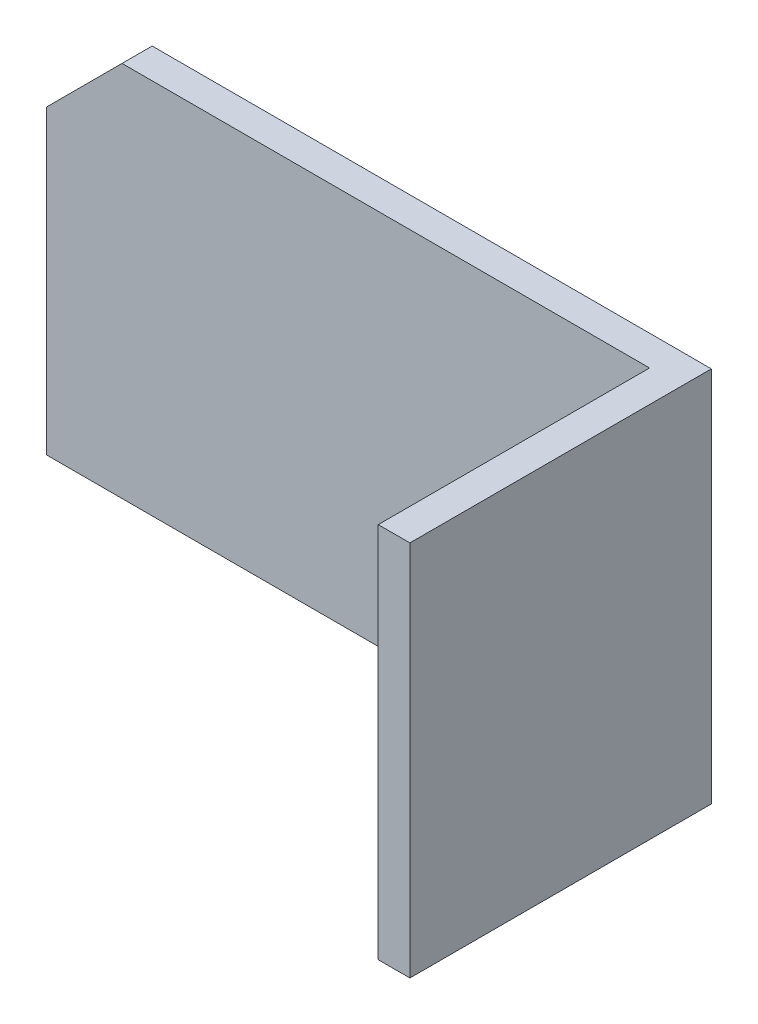
ISO-10303-21;
HEADER;
FILE_DESCRIPTION(('STEP AP214'),'2;1');
FILE_NAME('part.step','',(''),(''),'','','');
FILE_SCHEMA(('AUTOMOTIVE_DESIGN { 1 0 10303 214 1 1 1 1 }'));
ENDSEC;
DATA;
#1=APPLICATION_CONTEXT('core data for automotive mechanical design processes');
#2=APPLICATION_PROTOCOL_DEFINITION('international standard','automotive_design',2000,#1);
#3=PRODUCT_CONTEXT('',#1,'mechanical');
#4=PRODUCT('Part','Part','',(#3));
#5=PRODUCT_RELATED_PRODUCT_CATEGORY('part','',(#4));
#6=PRODUCT_DEFINITION_FORMATION('','',#4);
#7=PRODUCT_DEFINITION_CONTEXT('part definition',#1,'design');
#8=PRODUCT_DEFINITION('design','',#6,#7);
#9=PRODUCT_DEFINITION_SHAPE('','',#8);
#10=(LENGTH_UNIT() NAMED_UNIT(*) SI_UNIT(.MILLI.,.METRE.));
#11=(NAMED_UNIT(*) PLANE_ANGLE_UNIT() SI_UNIT($,.RADIAN.));
#12=(NAMED_UNIT(*) SI_UNIT($,.STERADIAN.) SOLID_ANGLE_UNIT());
#13=UNCERTAINTY_MEASURE_WITH_UNIT(LENGTH_MEASURE(1.E-05),#10,'distance_accuracy_value','');
#14=(GEOMETRIC_REPRESENTATION_CONTEXT(3) GLOBAL_UNCERTAINTY_ASSIGNED_CONTEXT((#13)) GLOBAL_UNIT_ASSIGNED_CONTEXT((#10,
#11,#12)) REPRESENTATION_CONTEXT('',''));
#15=CARTESIAN_POINT('',(0.,0.,0.));
#16=DIRECTION('',(0.,0.,1.));
#17=DIRECTION('',(1.,0.,0.));
#18=AXIS2_PLACEMENT_3D('',#15,#16,#17);
#19=CARTESIAN_POINT('',(1.48217930040456,0.75,0.2));
#20=DIRECTION('',(0.,0.,1.));
#21=DIRECTION('',(1.,0.,0.));
#22=AXIS2_PLACEMENT_3D('',#19,#20,#21);
#23=PLANE('',#22);
#24=DIRECTION('',(0.,-1.,0.));
#25=VECTOR('',#24,1.);
#26=CARTESIAN_POINT('',(1.49267930040456,0.75,0.2));
#27=LINE('',#26,#25);
#28=CARTESIAN_POINT('',(1.49267930040456,0.875,0.2));
#29=VERTEX_POINT('',#28);
#30=CARTESIAN_POINT('',(1.49267930040456,0.625,0.2));
#31=VERTEX_POINT('',#30);
#32=EDGE_CURVE('E94',#29,#31,#27,.T.);
#33=ORIENTED_EDGE('',*,*,#32,.F.);
#34=DIRECTION('',(1.,0.,0.));
#35=VECTOR('',#34,1.);
#36=CARTESIAN_POINT('',(1.36234567518565,0.875,0.2));
#37=LINE('',#36,#35);
#38=CARTESIAN_POINT('',(1.47167930040457,0.875,0.2));
#39=VERTEX_POINT('',#38);
#40=EDGE_CURVE('E92',#39,#29,#37,.T.);
#41=ORIENTED_EDGE('',*,*,#40,.F.);
#42=DIRECTION('',(0.,-1.,0.));
#43=VECTOR('',#42,1.);
#44=CARTESIAN_POINT('',(1.47167930040457,0.75,0.2));
#45=LINE('',#44,#43);
#46=CARTESIAN_POINT('',(1.47167930040457,0.625,0.2));
#47=VERTEX_POINT('',#46);
#48=EDGE_CURVE('E11',#39,#47,#45,.T.);
#49=ORIENTED_EDGE('',*,*,#48,.T.);
#50=DIRECTION('',(1.,0.,0.));
#51=VECTOR('',#50,1.);
#52=CARTESIAN_POINT('',(1.34015031489732,0.625,0.2));
#53=LINE('',#52,#51);
#54=EDGE_CURVE('E67',#47,#31,#53,.T.);
#55=ORIENTED_EDGE('',*,*,#54,.T.);
#56=EDGE_LOOP('',(#33,#41,#49,#55));
#57=FACE_BOUND('',#56,.T.);
#58=ADVANCED_FACE('F17',(#57),#23,.T.);
#59=CARTESIAN_POINT('',(1.27669667488565,0.746711342510851,0.02));
#60=DIRECTION('',(0.,0.,1.));
#61=DIRECTION('',(1.,0.,0.));
#62=AXIS2_PLACEMENT_3D('',#59,#60,#61);
#63=PLANE('',#62);
#64=DIRECTION('',(0.,-1.,0.));
#65=VECTOR('',#64,1.);
#66=CARTESIAN_POINT('',(1.07167930040456,0.725,0.02));
#67=LINE('',#66,#65);
#68=CARTESIAN_POINT('',(1.07167930040456,0.825,0.02));
#69=VERTEX_POINT('',#68);
#70=CARTESIAN_POINT('',(1.07167930040456,0.625,0.02));
#71=VERTEX_POINT('',#70);
#72=EDGE_CURVE('E117',#69,#71,#67,.T.);
#73=ORIENTED_EDGE('',*,*,#72,.T.);
#74=DIRECTION('',(1.,0.,0.));
#75=VECTOR('',#74,1.);
#76=CARTESIAN_POINT('',(1.34015031489732,0.625,0.02));
#77=LINE('',#76,#75);
#78=CARTESIAN_POINT('',(1.47167930040457,0.625,0.02));
#79=VERTEX_POINT('',#78);
#80=EDGE_CURVE('E118',#71,#79,#77,.T.);
#81=ORIENTED_EDGE('',*,*,#80,.T.);
#82=DIRECTION('',(0.,1.,0.));
#83=VECTOR('',#82,1.);
#84=CARTESIAN_POINT('',(1.47167930040457,0.75,0.02));
#85=LINE('',#84,#83);
#86=CARTESIAN_POINT('',(1.47167930040457,0.875,0.02));
#87=VERTEX_POINT('',#86);
#88=EDGE_CURVE('E27',#79,#87,#85,.T.);
#89=ORIENTED_EDGE('',*,*,#88,.T.);
#90=DIRECTION('',(1.,0.,0.));
#91=VECTOR('',#90,1.);
#92=CARTESIAN_POINT('',(1.36234567518565,0.875,0.02));
#93=LINE('',#92,#91);
#94=CARTESIAN_POINT('',(1.12167930040456,0.875,0.02));
#95=VERTEX_POINT('',#94);
#96=EDGE_CURVE('E103',#95,#87,#93,.T.);
#97=ORIENTED_EDGE('',*,*,#96,.F.);
#98=DIRECTION('',(-0.707106781186547,-0.707106781186548,0.));
#99=VECTOR('',#98,1.);
#100=CARTESIAN_POINT('',(1.09667930040456,0.85,0.02));
#101=LINE('',#100,#99);
#102=EDGE_CURVE('E40',#95,#69,#101,.T.);
#103=ORIENTED_EDGE('',*,*,#102,.T.);
#104=EDGE_LOOP('',(#73,#81,#89,#97,#103));
#105=FACE_BOUND('',#104,.T.);
#106=ADVANCED_FACE('F19',(#105),#63,.T.);
#107=CARTESIAN_POINT('',(1.47167930040457,0.75,0.11));
#108=DIRECTION('',(1.,0.,0.));
#109=DIRECTION('',(0.,0.,1.));
#110=AXIS2_PLACEMENT_3D('',#107,#108,#109);
#111=PLANE('',#110);
#112=DIRECTION('',(0.,0.,1.));
#113=VECTOR('',#112,1.);
#114=CARTESIAN_POINT('',(1.47167930040457,0.875,0.0448336252189136));
#115=LINE('',#114,#113);
#116=EDGE_CURVE('E87',#87,#39,#115,.T.);
#117=ORIENTED_EDGE('',*,*,#116,.F.);
#118=ORIENTED_EDGE('',*,*,#88,.F.);
#119=DIRECTION('',(0.,0.,1.));
#120=VECTOR('',#119,1.);
#121=CARTESIAN_POINT('',(1.47167930040457,0.625,0.0420289855072459));
#122=LINE('',#121,#120);
#123=EDGE_CURVE('E90',#79,#47,#122,.T.);
#124=ORIENTED_EDGE('',*,*,#123,.T.);
#125=ORIENTED_EDGE('',*,*,#48,.F.);
#126=EDGE_LOOP('',(#117,#118,#124,#125));
#127=FACE_BOUND('',#126,.T.);
#128=ADVANCED_FACE('F85',(#127),#111,.F.);
#129=CARTESIAN_POINT('',(1.09667930040456,0.85,0.01));
#130=DIRECTION('',(0.707106781186548,-0.707106781186547,0.));
#131=DIRECTION('',(0.,0.,-1.));
#132=AXIS2_PLACEMENT_3D('',#129,#130,#131);
#133=PLANE('',#132);
#134=DIRECTION('',(0.,0.,1.));
#135=VECTOR('',#134,1.);
#136=CARTESIAN_POINT('',(1.07167930040456,0.825,0.01));
#137=LINE('',#136,#135);
#138=CARTESIAN_POINT('',(1.07167930040456,0.825,0.));
#139=VERTEX_POINT('',#138);
#140=EDGE_CURVE('E131',#139,#69,#137,.T.);
#141=ORIENTED_EDGE('',*,*,#140,.T.);
#142=ORIENTED_EDGE('',*,*,#102,.F.);
#143=DIRECTION('',(0.,0.,1.));
#144=VECTOR('',#143,1.);
#145=CARTESIAN_POINT('',(1.12167930040456,0.875,0.0448336252189136));
#146=LINE('',#145,#144);
#147=CARTESIAN_POINT('',(1.12167930040456,0.875,0.));
#148=VERTEX_POINT('',#147);
#149=EDGE_CURVE('E126',#148,#95,#146,.T.);
#150=ORIENTED_EDGE('',*,*,#149,.F.);
#151=DIRECTION('',(-0.707106781186541,-0.707106781186554,0.));
#152=VECTOR('',#151,1.);
#153=CARTESIAN_POINT('',(1.12167930040456,0.875,0.));
#154=LINE('',#153,#152);
#155=EDGE_CURVE('E148',#148,#139,#154,.T.);
#156=ORIENTED_EDGE('',*,*,#155,.T.);
#157=EDGE_LOOP('',(#141,#142,#150,#156));
#158=FACE_BOUND('',#157,.T.);
#159=ADVANCED_FACE('F167',(#158),#133,.F.);
#160=CARTESIAN_POINT('',(1.07167930040456,0.725,0.01));
#161=DIRECTION('',(1.,0.,0.));
#162=DIRECTION('',(0.,0.,1.));
#163=AXIS2_PLACEMENT_3D('',#160,#161,#162);
#164=PLANE('',#163);
#165=DIRECTION('',(0.,0.,1.));
#166=VECTOR('',#165,1.);
#167=CARTESIAN_POINT('',(1.07167930040456,0.625,0.0420289855072459));
#168=LINE('',#167,#166);
#169=CARTESIAN_POINT('',(1.07167930040456,0.625,0.));
#170=VERTEX_POINT('',#169);
#171=EDGE_CURVE('E114',#170,#71,#168,.T.);
#172=ORIENTED_EDGE('',*,*,#171,.T.);
#173=ORIENTED_EDGE('',*,*,#72,.F.);
#174=ORIENTED_EDGE('',*,*,#140,.F.);
#175=DIRECTION('',(0.,-1.,0.));
#176=VECTOR('',#175,1.);
#177=CARTESIAN_POINT('',(1.07167930040456,0.746816562660918,0.));
#178=LINE('',#177,#176);
#179=EDGE_CURVE('E144',#139,#170,#178,.T.);
#180=ORIENTED_EDGE('',*,*,#179,.T.);
#181=EDGE_LOOP('',(#172,#173,#174,#180));
#182=FACE_BOUND('',#181,.T.);
#183=ADVANCED_FACE('F353',(#182),#164,.F.);
#184=CARTESIAN_POINT('',(1.34015031489732,0.625,0.0420289855072459));
#185=DIRECTION('',(0.,1.,0.));
#186=DIRECTION('',(0.,0.,-1.));
#187=AXIS2_PLACEMENT_3D('',#184,#185,#186);
#188=PLANE('',#187);
#189=DIRECTION('',(0.,0.,-1.));
#190=VECTOR('',#189,1.);
#191=CARTESIAN_POINT('',(1.49267930040456,0.625,0.0999999999999988));
#192=LINE('',#191,#190);
#193=CARTESIAN_POINT('',(1.49267930040456,0.625,0.));
#194=VERTEX_POINT('',#193);
#195=EDGE_CURVE('E120',#31,#194,#192,.T.);
#196=ORIENTED_EDGE('',*,*,#195,.F.);
#197=ORIENTED_EDGE('',*,*,#54,.F.);
#198=ORIENTED_EDGE('',*,*,#123,.F.);
#199=ORIENTED_EDGE('',*,*,#80,.F.);
#200=ORIENTED_EDGE('',*,*,#171,.F.);
#201=DIRECTION('',(1.,0.,0.));
#202=VECTOR('',#201,1.);
#203=CARTESIAN_POINT('',(1.28727042163972,0.625,0.));
#204=LINE('',#203,#202);
#205=EDGE_CURVE('E149',#170,#194,#204,.T.);
#206=ORIENTED_EDGE('',*,*,#205,.T.);
#207=EDGE_LOOP('',(#196,#197,#198,#199,#200,#206));
#208=FACE_BOUND('',#207,.T.);
#209=ADVANCED_FACE('F195',(#208),#188,.F.);
#210=CARTESIAN_POINT('',(1.49267930040456,0.75,0.0999999999999988));
#211=DIRECTION('',(1.,0.,0.));
#212=DIRECTION('',(0.,-1.,0.));
#213=AXIS2_PLACEMENT_3D('',#210,#211,#212);
#214=PLANE('',#213);
#215=ORIENTED_EDGE('',*,*,#32,.T.);
#216=ORIENTED_EDGE('',*,*,#195,.T.);
#217=DIRECTION('',(0.,1.,0.));
#218=VECTOR('',#217,1.);
#219=CARTESIAN_POINT('',(1.49267930040456,0.746816562660918,0.));
#220=LINE('',#219,#218);
#221=CARTESIAN_POINT('',(1.49267930040456,0.875,0.));
#222=VERTEX_POINT('',#221);
#223=EDGE_CURVE('E194',#194,#222,#220,.T.);
#224=ORIENTED_EDGE('',*,*,#223,.T.);
#225=DIRECTION('',(0.,0.,-1.));
#226=VECTOR('',#225,1.);
#227=CARTESIAN_POINT('',(1.49267930040456,0.875,0.0448336252189136));
#228=LINE('',#227,#226);
#229=EDGE_CURVE('E99',#29,#222,#228,.T.);
#230=ORIENTED_EDGE('',*,*,#229,.F.);
#231=EDGE_LOOP('',(#215,#216,#224,#230));
#232=FACE_BOUND('',#231,.T.);
#233=ADVANCED_FACE('F193',(#232),#214,.T.);
#234=CARTESIAN_POINT('',(1.36234567518565,0.875,0.0448336252189136));
#235=DIRECTION('',(0.,1.,0.));
#236=DIRECTION('',(1.,0.,0.));
#237=AXIS2_PLACEMENT_3D('',#234,#235,#236);
#238=PLANE('',#237);
#239=ORIENTED_EDGE('',*,*,#96,.T.);
#240=ORIENTED_EDGE('',*,*,#116,.T.);
#241=ORIENTED_EDGE('',*,*,#40,.T.);
#242=ORIENTED_EDGE('',*,*,#229,.T.);
#243=DIRECTION('',(-1.,0.,0.));
#244=VECTOR('',#243,1.);
#245=CARTESIAN_POINT('',(1.28727042163972,0.875,0.));
#246=LINE('',#245,#244);
#247=EDGE_CURVE('E110',#222,#148,#246,.T.);
#248=ORIENTED_EDGE('',*,*,#247,.T.);
#249=ORIENTED_EDGE('',*,*,#149,.T.);
#250=EDGE_LOOP('',(#239,#240,#241,#242,#248,#249));
#251=FACE_BOUND('',#250,.T.);
#252=ADVANCED_FACE('F101',(#251),#238,.T.);
#253=CARTESIAN_POINT('',(1.28727042163972,0.746816562660918,0.));
#254=DIRECTION('',(0.,0.,1.));
#255=DIRECTION('',(1.,0.,0.));
#256=AXIS2_PLACEMENT_3D('',#253,#254,#255);
#257=PLANE('',#256);
#258=ORIENTED_EDGE('',*,*,#223,.F.);
#259=ORIENTED_EDGE('',*,*,#205,.F.);
#260=ORIENTED_EDGE('',*,*,#179,.F.);
#261=ORIENTED_EDGE('',*,*,#155,.F.);
#262=ORIENTED_EDGE('',*,*,#247,.F.);
#263=EDGE_LOOP('',(#258,#259,#260,#261,#262));
#264=FACE_BOUND('',#263,.T.);
#265=ADVANCED_FACE('F164',(#264),#257,.F.);
#266=CLOSED_SHELL('',(#58,#106,#128,#159,#183,#209,#233,#252,#265));
#267=MANIFOLD_SOLID_BREP('B1',#266);
#268=ADVANCED_BREP_SHAPE_REPRESENTATION('',(#18,#267),#14);
#269=SHAPE_DEFINITION_REPRESENTATION(#9,#268);
ENDSEC;
END-ISO-10303-21;
